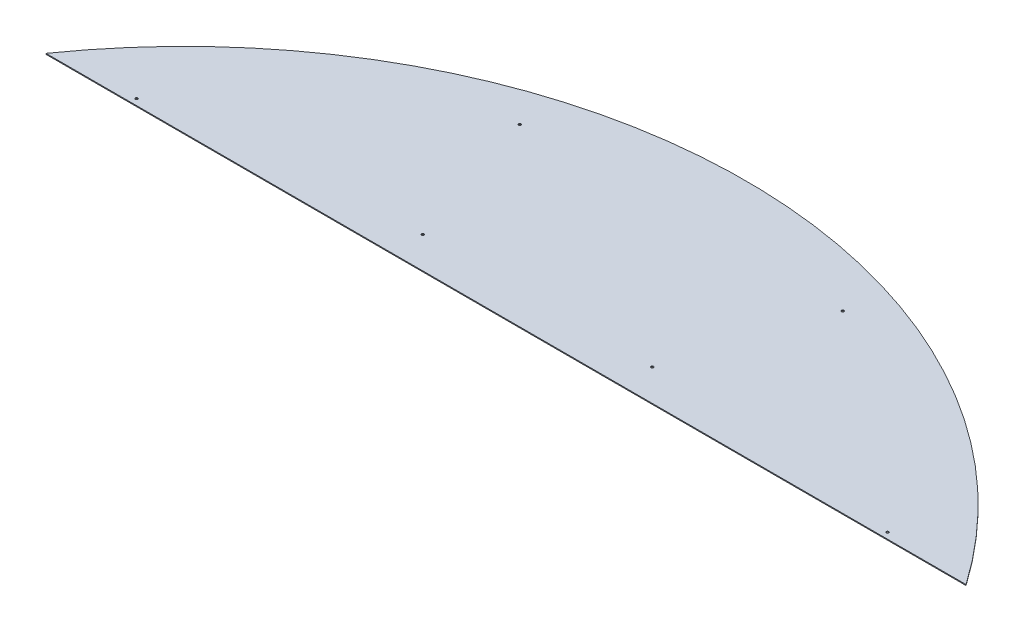
ISO-10303-21;
HEADER;
FILE_DESCRIPTION(('STEP AP214'),'2;1');
FILE_NAME('part.step','',(''),(''),'','','');
FILE_SCHEMA(('AUTOMOTIVE_DESIGN { 1 0 10303 214 1 1 1 1 }'));
ENDSEC;
DATA;
#1=APPLICATION_CONTEXT('core data for automotive mechanical design processes');
#2=APPLICATION_PROTOCOL_DEFINITION('international standard','automotive_design',2000,#1);
#3=PRODUCT_CONTEXT('',#1,'mechanical');
#4=PRODUCT('Part','Part','',(#3));
#5=PRODUCT_RELATED_PRODUCT_CATEGORY('part','',(#4));
#6=PRODUCT_DEFINITION_FORMATION('','',#4);
#7=PRODUCT_DEFINITION_CONTEXT('part definition',#1,'design');
#8=PRODUCT_DEFINITION('design','',#6,#7);
#9=PRODUCT_DEFINITION_SHAPE('','',#8);
#10=(LENGTH_UNIT() NAMED_UNIT(*) SI_UNIT(.MILLI.,.METRE.));
#11=(NAMED_UNIT(*) PLANE_ANGLE_UNIT() SI_UNIT($,.RADIAN.));
#12=(NAMED_UNIT(*) SI_UNIT($,.STERADIAN.) SOLID_ANGLE_UNIT());
#13=UNCERTAINTY_MEASURE_WITH_UNIT(LENGTH_MEASURE(1.E-05),#10,'distance_accuracy_value','');
#14=(GEOMETRIC_REPRESENTATION_CONTEXT(3) GLOBAL_UNCERTAINTY_ASSIGNED_CONTEXT((#13)) GLOBAL_UNIT_ASSIGNED_CONTEXT((#10,
#11,#12)) REPRESENTATION_CONTEXT('',''));
#15=CARTESIAN_POINT('',(0.,0.,0.));
#16=DIRECTION('',(0.,0.,1.));
#17=DIRECTION('',(1.,0.,0.));
#18=AXIS2_PLACEMENT_3D('',#15,#16,#17);
#19=CARTESIAN_POINT('',(0.,1198.5,0.));
#20=DIRECTION('',(0.,-1.,0.));
#21=DIRECTION('',(0.,0.,-1.));
#22=AXIS2_PLACEMENT_3D('',#19,#20,#21);
#23=CYLINDRICAL_SURFACE('',#22,928.);
#24=CARTESIAN_POINT('',(0.,1197.,0.));
#25=DIRECTION('',(0.,1.,0.));
#26=DIRECTION('',(0.,0.,1.));
#27=AXIS2_PLACEMENT_3D('',#24,#25,#26);
#28=CIRCLE('',#27,928.);
#29=CARTESIAN_POINT('',(760.368331797162,1197.,-532.));
#30=VERTEX_POINT('',#29);
#31=CARTESIAN_POINT('',(-760.368331797163,1197.,-532.));
#32=VERTEX_POINT('',#31);
#33=EDGE_CURVE('E76',#30,#32,#28,.T.);
#34=ORIENTED_EDGE('',*,*,#33,.T.);
#35=DIRECTION('',(0.,-1.,0.));
#36=VECTOR('',#35,1.);
#37=CARTESIAN_POINT('',(-760.368331797163,1198.5,-532.));
#38=LINE('',#37,#36);
#39=CARTESIAN_POINT('',(-760.368331797163,1198.5,-532.));
#40=VERTEX_POINT('',#39);
#41=EDGE_CURVE('E11',#40,#32,#38,.T.);
#42=ORIENTED_EDGE('',*,*,#41,.F.);
#43=CARTESIAN_POINT('',(0.,1198.5,0.));
#44=DIRECTION('',(0.,1.,0.));
#45=DIRECTION('',(0.,0.,1.));
#46=AXIS2_PLACEMENT_3D('',#43,#44,#45);
#47=CIRCLE('',#46,928.);
#48=CARTESIAN_POINT('',(760.368331797162,1198.5,-532.));
#49=VERTEX_POINT('',#48);
#50=EDGE_CURVE('E75',#49,#40,#47,.T.);
#51=ORIENTED_EDGE('',*,*,#50,.F.);
#52=DIRECTION('',(0.,-1.,0.));
#53=VECTOR('',#52,1.);
#54=CARTESIAN_POINT('',(760.368331797162,1198.5,-532.));
#55=LINE('',#54,#53);
#56=EDGE_CURVE('E51',#49,#30,#55,.T.);
#57=ORIENTED_EDGE('',*,*,#56,.T.);
#58=EDGE_LOOP('',(#34,#42,#51,#57));
#59=FACE_BOUND('',#58,.T.);
#60=ADVANCED_FACE('F40',(#59),#23,.T.);
#61=CARTESIAN_POINT('',(-760.368331797163,1198.5,-532.));
#62=DIRECTION('',(0.,0.,-1.));
#63=DIRECTION('',(-1.,0.,0.));
#64=AXIS2_PLACEMENT_3D('',#61,#62,#63);
#65=PLANE('',#64);
#66=DIRECTION('',(1.,0.,0.));
#67=VECTOR('',#66,1.);
#68=CARTESIAN_POINT('',(-760.368331797163,1197.,-532.));
#69=LINE('',#68,#67);
#70=EDGE_CURVE('E67',#32,#30,#69,.T.);
#71=ORIENTED_EDGE('',*,*,#70,.T.);
#72=ORIENTED_EDGE('',*,*,#56,.F.);
#73=DIRECTION('',(1.,0.,0.));
#74=VECTOR('',#73,1.);
#75=CARTESIAN_POINT('',(-760.368331797163,1198.5,-532.));
#76=LINE('',#75,#74);
#77=EDGE_CURVE('E59',#40,#49,#76,.T.);
#78=ORIENTED_EDGE('',*,*,#77,.F.);
#79=ORIENTED_EDGE('',*,*,#41,.T.);
#80=EDGE_LOOP('',(#71,#72,#78,#79));
#81=FACE_BOUND('',#80,.T.);
#82=ADVANCED_FACE('F70',(#81),#65,.F.);
#83=CARTESIAN_POINT('',(0.,1198.5,0.));
#84=DIRECTION('',(0.,1.,0.));
#85=DIRECTION('',(0.,0.,1.));
#86=AXIS2_PLACEMENT_3D('',#83,#84,#85);
#87=PLANE('',#86);
#88=CARTESIAN_POINT('',(620.654493256916,1198.5,-542.));
#89=DIRECTION('',(0.,1.,0.));
#90=DIRECTION('',(0.,0.,1.));
#91=AXIS2_PLACEMENT_3D('',#88,#89,#90);
#92=CIRCLE('',#91,2.10000000000006);
#93=CARTESIAN_POINT('',(620.654493256916,1198.5,-539.9));
#94=VERTEX_POINT('',#93);
#95=EDGE_CURVE('E95',#94,#94,#92,.T.);
#96=ORIENTED_EDGE('',*,*,#95,.F.);
#97=EDGE_LOOP('',(#96));
#98=FACE_BOUND('',#97,.T.);
#99=CARTESIAN_POINT('',(-620.654493256916,1198.5,-541.99999999998));
#100=DIRECTION('',(0.,1.,0.));
#101=DIRECTION('',(0.,0.,-1.));
#102=AXIS2_PLACEMENT_3D('',#99,#100,#101);
#103=CIRCLE('',#102,2.10000000000024);
#104=CARTESIAN_POINT('',(-620.654493256916,1198.5,-544.09999999998));
#105=VERTEX_POINT('',#104);
#106=EDGE_CURVE('E104',#105,#105,#103,.T.);
#107=ORIENTED_EDGE('',*,*,#106,.F.);
#108=EDGE_LOOP('',(#107));
#109=FACE_BOUND('',#108,.T.);
#110=CARTESIAN_POINT('',(-266.990683139964,1198.5,-821.71283007901));
#111=DIRECTION('',(0.,1.,0.));
#112=DIRECTION('',(-0.95105651629515,0.,0.309016994374958));
#113=AXIS2_PLACEMENT_3D('',#110,#111,#112);
#114=CIRCLE('',#113,2.10000000000004);
#115=CARTESIAN_POINT('',(-268.987901824183,1198.5,-821.063894390822));
#116=VERTEX_POINT('',#115);
#117=EDGE_CURVE('E101',#116,#116,#114,.T.);
#118=ORIENTED_EDGE('',*,*,#117,.F.);
#119=EDGE_LOOP('',(#118));
#120=FACE_BOUND('',#119,.T.);
#121=CARTESIAN_POINT('',(266.990683139947,1198.5,-821.712830079015));
#122=DIRECTION('',(0.,1.,0.));
#123=DIRECTION('',(-0.951056516295157,0.,-0.309016994374938));
#124=AXIS2_PLACEMENT_3D('',#121,#122,#123);
#125=CIRCLE('',#124,2.10000000000004);
#126=CARTESIAN_POINT('',(264.993464455727,1198.5,-822.361765767203));
#127=VERTEX_POINT('',#126);
#128=EDGE_CURVE('E113',#127,#127,#125,.T.);
#129=ORIENTED_EDGE('',*,*,#128,.F.);
#130=EDGE_LOOP('',(#129));
#131=FACE_BOUND('',#130,.T.);
#132=CARTESIAN_POINT('',(-189.736434546224,1198.5,-583.948701005222));
#133=DIRECTION('',(0.,1.,0.));
#134=DIRECTION('',(-0.95105651629515,0.,0.309016994374958));
#135=AXIS2_PLACEMENT_3D('',#132,#133,#134);
#136=CIRCLE('',#135,2.10000000000004);
#137=CARTESIAN_POINT('',(-191.733653230444,1198.5,-583.299765317035));
#138=VERTEX_POINT('',#137);
#139=EDGE_CURVE('E122',#138,#138,#136,.T.);
#140=ORIENTED_EDGE('',*,*,#139,.F.);
#141=EDGE_LOOP('',(#140));
#142=FACE_BOUND('',#141,.T.);
#143=CARTESIAN_POINT('',(189.736434546212,1198.5,-583.948701005226));
#144=DIRECTION('',(0.,1.,0.));
#145=DIRECTION('',(-0.951056516295157,0.,-0.309016994374938));
#146=AXIS2_PLACEMENT_3D('',#143,#144,#145);
#147=CIRCLE('',#146,2.10000000000004);
#148=CARTESIAN_POINT('',(187.739215861993,1198.5,-584.597636693414));
#149=VERTEX_POINT('',#148);
#150=EDGE_CURVE('E88',#149,#149,#147,.T.);
#151=ORIENTED_EDGE('',*,*,#150,.F.);
#152=EDGE_LOOP('',(#151));
#153=FACE_BOUND('',#152,.T.);
#154=ORIENTED_EDGE('',*,*,#50,.T.);
#155=ORIENTED_EDGE('',*,*,#77,.T.);
#156=EDGE_LOOP('',(#154,#155));
#157=FACE_BOUND('',#156,.T.);
#158=ADVANCED_FACE('F42',(#98,#109,#120,#131,#142,#153,#157),#87,.T.);
#159=CARTESIAN_POINT('',(0.,1197.,0.));
#160=DIRECTION('',(0.,1.,0.));
#161=DIRECTION('',(0.,0.,1.));
#162=AXIS2_PLACEMENT_3D('',#159,#160,#161);
#163=PLANE('',#162);
#164=CARTESIAN_POINT('',(620.654493256916,1197.,-542.));
#165=DIRECTION('',(0.,1.,0.));
#166=DIRECTION('',(0.,0.,1.));
#167=AXIS2_PLACEMENT_3D('',#164,#165,#166);
#168=CIRCLE('',#167,2.10000000000006);
#169=CARTESIAN_POINT('',(620.654493256916,1197.,-539.9));
#170=VERTEX_POINT('',#169);
#171=EDGE_CURVE('E44',#170,#170,#168,.T.);
#172=ORIENTED_EDGE('',*,*,#171,.T.);
#173=EDGE_LOOP('',(#172));
#174=FACE_BOUND('',#173,.T.);
#175=CARTESIAN_POINT('',(-620.654493256916,1197.,-541.99999999998));
#176=DIRECTION('',(0.,1.,0.));
#177=DIRECTION('',(0.,0.,1.));
#178=AXIS2_PLACEMENT_3D('',#175,#176,#177);
#179=CIRCLE('',#178,2.10000000000024);
#180=CARTESIAN_POINT('',(-620.654493256916,1197.,-539.89999999998));
#181=VERTEX_POINT('',#180);
#182=EDGE_CURVE('E92',#181,#181,#179,.T.);
#183=ORIENTED_EDGE('',*,*,#182,.T.);
#184=EDGE_LOOP('',(#183));
#185=FACE_BOUND('',#184,.T.);
#186=CARTESIAN_POINT('',(-266.990683139964,1197.,-821.71283007901));
#187=DIRECTION('',(0.,1.,0.));
#188=DIRECTION('',(-0.95105651629515,0.,0.309016994374958));
#189=AXIS2_PLACEMENT_3D('',#186,#187,#188);
#190=CIRCLE('',#189,2.10000000000004);
#191=CARTESIAN_POINT('',(-268.987901824183,1197.,-821.063894390822));
#192=VERTEX_POINT('',#191);
#193=EDGE_CURVE('E118',#192,#192,#190,.T.);
#194=ORIENTED_EDGE('',*,*,#193,.T.);
#195=EDGE_LOOP('',(#194));
#196=FACE_BOUND('',#195,.T.);
#197=CARTESIAN_POINT('',(266.990683139947,1197.,-821.712830079015));
#198=DIRECTION('',(0.,1.,0.));
#199=DIRECTION('',(-0.951056516295157,0.,-0.309016994374938));
#200=AXIS2_PLACEMENT_3D('',#197,#198,#199);
#201=CIRCLE('',#200,2.10000000000004);
#202=CARTESIAN_POINT('',(264.993464455727,1197.,-822.361765767203));
#203=VERTEX_POINT('',#202);
#204=EDGE_CURVE('E117',#203,#203,#201,.T.);
#205=ORIENTED_EDGE('',*,*,#204,.T.);
#206=EDGE_LOOP('',(#205));
#207=FACE_BOUND('',#206,.T.);
#208=CARTESIAN_POINT('',(-189.736434546224,1197.,-583.948701005222));
#209=DIRECTION('',(0.,1.,0.));
#210=DIRECTION('',(-0.95105651629515,0.,0.309016994374958));
#211=AXIS2_PLACEMENT_3D('',#208,#209,#210);
#212=CIRCLE('',#211,2.10000000000004);
#213=CARTESIAN_POINT('',(-191.733653230444,1197.,-583.299765317035));
#214=VERTEX_POINT('',#213);
#215=EDGE_CURVE('E131',#214,#214,#212,.T.);
#216=ORIENTED_EDGE('',*,*,#215,.T.);
#217=EDGE_LOOP('',(#216));
#218=FACE_BOUND('',#217,.T.);
#219=CARTESIAN_POINT('',(189.736434546212,1197.,-583.948701005226));
#220=DIRECTION('',(0.,1.,0.));
#221=DIRECTION('',(-0.951056516295157,0.,-0.309016994374938));
#222=AXIS2_PLACEMENT_3D('',#219,#220,#221);
#223=CIRCLE('',#222,2.10000000000004);
#224=CARTESIAN_POINT('',(187.739215861993,1197.,-584.597636693414));
#225=VERTEX_POINT('',#224);
#226=EDGE_CURVE('E83',#225,#225,#223,.T.);
#227=ORIENTED_EDGE('',*,*,#226,.T.);
#228=EDGE_LOOP('',(#227));
#229=FACE_BOUND('',#228,.T.);
#230=ORIENTED_EDGE('',*,*,#33,.F.);
#231=ORIENTED_EDGE('',*,*,#70,.F.);
#232=EDGE_LOOP('',(#230,#231));
#233=FACE_BOUND('',#232,.T.);
#234=ADVANCED_FACE('F81',(#174,#185,#196,#207,#218,#229,#233),#163,.F.);
#235=CARTESIAN_POINT('',(189.736434546212,1173.5,-583.948701005226));
#236=DIRECTION('',(0.,1.,0.));
#237=DIRECTION('',(-0.951056516295157,0.,-0.309016994374938));
#238=AXIS2_PLACEMENT_3D('',#235,#236,#237);
#239=CYLINDRICAL_SURFACE('',#238,2.10000000000004);
#240=ORIENTED_EDGE('',*,*,#150,.T.);
#241=EDGE_LOOP('',(#240));
#242=FACE_BOUND('',#241,.T.);
#243=ORIENTED_EDGE('',*,*,#226,.F.);
#244=EDGE_LOOP('',(#243));
#245=FACE_BOUND('',#244,.T.);
#246=ADVANCED_FACE('F148',(#242,#245),#239,.F.);
#247=CARTESIAN_POINT('',(-189.736434546224,1173.5,-583.948701005222));
#248=DIRECTION('',(0.,1.,0.));
#249=DIRECTION('',(-0.95105651629515,0.,0.309016994374958));
#250=AXIS2_PLACEMENT_3D('',#247,#248,#249);
#251=CYLINDRICAL_SURFACE('',#250,2.10000000000004);
#252=ORIENTED_EDGE('',*,*,#139,.T.);
#253=EDGE_LOOP('',(#252));
#254=FACE_BOUND('',#253,.T.);
#255=ORIENTED_EDGE('',*,*,#215,.F.);
#256=EDGE_LOOP('',(#255));
#257=FACE_BOUND('',#256,.T.);
#258=ADVANCED_FACE('F157',(#254,#257),#251,.F.);
#259=CARTESIAN_POINT('',(266.990683139947,1173.5,-821.712830079015));
#260=DIRECTION('',(0.,1.,0.));
#261=DIRECTION('',(-0.951056516295157,0.,-0.309016994374938));
#262=AXIS2_PLACEMENT_3D('',#259,#260,#261);
#263=CYLINDRICAL_SURFACE('',#262,2.10000000000004);
#264=ORIENTED_EDGE('',*,*,#128,.T.);
#265=EDGE_LOOP('',(#264));
#266=FACE_BOUND('',#265,.T.);
#267=ORIENTED_EDGE('',*,*,#204,.F.);
#268=EDGE_LOOP('',(#267));
#269=FACE_BOUND('',#268,.T.);
#270=ADVANCED_FACE('F160',(#266,#269),#263,.F.);
#271=CARTESIAN_POINT('',(-266.990683139964,1173.5,-821.71283007901));
#272=DIRECTION('',(0.,1.,0.));
#273=DIRECTION('',(-0.95105651629515,0.,0.309016994374958));
#274=AXIS2_PLACEMENT_3D('',#271,#272,#273);
#275=CYLINDRICAL_SURFACE('',#274,2.10000000000004);
#276=ORIENTED_EDGE('',*,*,#117,.T.);
#277=EDGE_LOOP('',(#276));
#278=FACE_BOUND('',#277,.T.);
#279=ORIENTED_EDGE('',*,*,#193,.F.);
#280=EDGE_LOOP('',(#279));
#281=FACE_BOUND('',#280,.T.);
#282=ADVANCED_FACE('F165',(#278,#281),#275,.F.);
#283=CARTESIAN_POINT('',(-620.654493256916,1173.5,-541.99999999998));
#284=DIRECTION('',(0.,1.,0.));
#285=DIRECTION('',(0.,0.,1.));
#286=AXIS2_PLACEMENT_3D('',#283,#284,#285);
#287=CYLINDRICAL_SURFACE('',#286,2.10000000000024);
#288=ORIENTED_EDGE('',*,*,#106,.T.);
#289=EDGE_LOOP('',(#288));
#290=FACE_BOUND('',#289,.T.);
#291=ORIENTED_EDGE('',*,*,#182,.F.);
#292=EDGE_LOOP('',(#291));
#293=FACE_BOUND('',#292,.T.);
#294=ADVANCED_FACE('F168',(#290,#293),#287,.F.);
#295=CARTESIAN_POINT('',(620.654493256916,1173.5,-542.));
#296=DIRECTION('',(0.,1.,0.));
#297=DIRECTION('',(0.,0.,1.));
#298=AXIS2_PLACEMENT_3D('',#295,#296,#297);
#299=CYLINDRICAL_SURFACE('',#298,2.10000000000006);
#300=ORIENTED_EDGE('',*,*,#95,.T.);
#301=EDGE_LOOP('',(#300));
#302=FACE_BOUND('',#301,.T.);
#303=ORIENTED_EDGE('',*,*,#171,.F.);
#304=EDGE_LOOP('',(#303));
#305=FACE_BOUND('',#304,.T.);
#306=ADVANCED_FACE('F175',(#302,#305),#299,.F.);
#307=CLOSED_SHELL('',(#60,#82,#158,#234,#246,#258,#270,#282,#294,#306));
#308=MANIFOLD_SOLID_BREP('B2',#307);
#309=ADVANCED_BREP_SHAPE_REPRESENTATION('',(#18,#308),#14);
#310=SHAPE_DEFINITION_REPRESENTATION(#9,#309);
ENDSEC;
END-ISO-10303-21;
